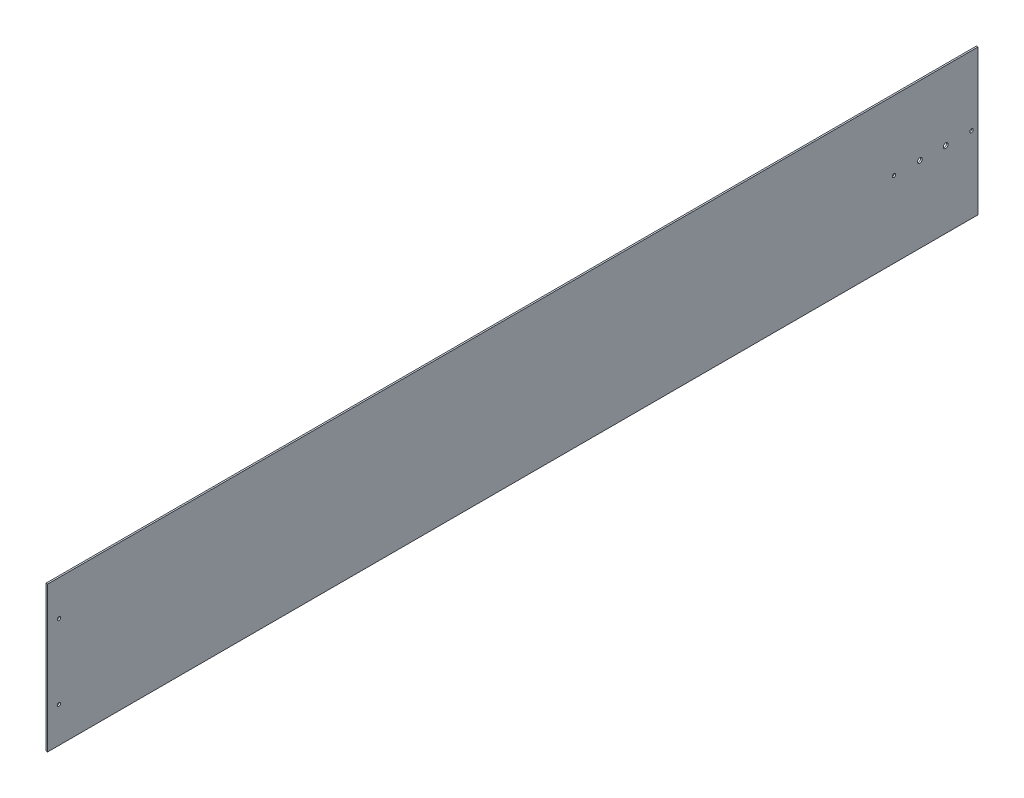
ISO-10303-21;
HEADER;
FILE_DESCRIPTION(('STEP AP214'),'2;1');
FILE_NAME('part.step','',(''),(''),'','','');
FILE_SCHEMA(('AUTOMOTIVE_DESIGN { 1 0 10303 214 1 1 1 1 }'));
ENDSEC;
DATA;
#1=APPLICATION_CONTEXT('core data for automotive mechanical design processes');
#2=APPLICATION_PROTOCOL_DEFINITION('international standard','automotive_design',2000,#1);
#3=PRODUCT_CONTEXT('',#1,'mechanical');
#4=PRODUCT('Part','Part','',(#3));
#5=PRODUCT_RELATED_PRODUCT_CATEGORY('part','',(#4));
#6=PRODUCT_DEFINITION_FORMATION('','',#4);
#7=PRODUCT_DEFINITION_CONTEXT('part definition',#1,'design');
#8=PRODUCT_DEFINITION('design','',#6,#7);
#9=PRODUCT_DEFINITION_SHAPE('','',#8);
#10=(LENGTH_UNIT() NAMED_UNIT(*) SI_UNIT(.MILLI.,.METRE.));
#11=(NAMED_UNIT(*) PLANE_ANGLE_UNIT() SI_UNIT($,.RADIAN.));
#12=(NAMED_UNIT(*) SI_UNIT($,.STERADIAN.) SOLID_ANGLE_UNIT());
#13=UNCERTAINTY_MEASURE_WITH_UNIT(LENGTH_MEASURE(1.E-05),#10,'distance_accuracy_value','');
#14=(GEOMETRIC_REPRESENTATION_CONTEXT(3) GLOBAL_UNCERTAINTY_ASSIGNED_CONTEXT((#13)) GLOBAL_UNIT_ASSIGNED_CONTEXT((#10,
#11,#12)) REPRESENTATION_CONTEXT('',''));
#15=CARTESIAN_POINT('',(0.,0.,0.));
#16=DIRECTION('',(0.,0.,1.));
#17=DIRECTION('',(1.,0.,0.));
#18=AXIS2_PLACEMENT_3D('',#15,#16,#17);
#19=CARTESIAN_POINT('',(3.175,0.,0.));
#20=DIRECTION('',(1.,0.,0.));
#21=DIRECTION('',(0.,0.,-1.));
#22=AXIS2_PLACEMENT_3D('',#19,#20,#21);
#23=PLANE('',#22);
#24=CARTESIAN_POINT('',(3.175,73.025,892.175));
#25=DIRECTION('',(1.,0.,0.));
#26=DIRECTION('',(0.,0.,-1.));
#27=AXIS2_PLACEMENT_3D('',#24,#25,#26);
#28=CIRCLE('',#27,3.302);
#29=CARTESIAN_POINT('',(3.175,73.025,888.873));
#30=VERTEX_POINT('',#29);
#31=EDGE_CURVE('E98',#30,#30,#28,.F.);
#32=ORIENTED_EDGE('',*,*,#31,.T.);
#33=EDGE_LOOP('',(#32));
#34=FACE_BOUND('',#33,.T.);
#35=CARTESIAN_POINT('',(3.175,-73.025,892.175));
#36=DIRECTION('',(1.,0.,0.));
#37=DIRECTION('',(0.,0.,-1.));
#38=AXIS2_PLACEMENT_3D('',#35,#36,#37);
#39=CIRCLE('',#38,3.302);
#40=CARTESIAN_POINT('',(3.175,-73.025,888.873));
#41=VERTEX_POINT('',#40);
#42=EDGE_CURVE('E101',#41,#41,#39,.F.);
#43=ORIENTED_EDGE('',*,*,#42,.T.);
#44=EDGE_LOOP('',(#43));
#45=FACE_BOUND('',#44,.T.);
#46=CARTESIAN_POINT('',(3.175,6.604,-749.3));
#47=DIRECTION('',(-1.,0.,0.));
#48=DIRECTION('',(0.,0.,1.));
#49=AXIS2_PLACEMENT_3D('',#46,#47,#48);
#50=CIRCLE('',#49,3.3655);
#51=CARTESIAN_POINT('',(3.175,6.604,-745.9345));
#52=VERTEX_POINT('',#51);
#53=EDGE_CURVE('E104',#52,#52,#50,.T.);
#54=ORIENTED_EDGE('',*,*,#53,.T.);
#55=EDGE_LOOP('',(#54));
#56=FACE_BOUND('',#55,.T.);
#57=CARTESIAN_POINT('',(3.175,6.604,-800.1));
#58=DIRECTION('',(-1.,0.,0.));
#59=DIRECTION('',(0.,0.,1.));
#60=AXIS2_PLACEMENT_3D('',#57,#58,#59);
#61=CIRCLE('',#60,4.7625);
#62=CARTESIAN_POINT('',(3.175,6.604,-795.3375));
#63=VERTEX_POINT('',#62);
#64=EDGE_CURVE('E107',#63,#63,#61,.T.);
#65=ORIENTED_EDGE('',*,*,#64,.T.);
#66=EDGE_LOOP('',(#65));
#67=FACE_BOUND('',#66,.T.);
#68=CARTESIAN_POINT('',(3.175,6.604,-850.9));
#69=DIRECTION('',(-1.,0.,0.));
#70=DIRECTION('',(0.,0.,1.));
#71=AXIS2_PLACEMENT_3D('',#68,#69,#70);
#72=CIRCLE('',#71,4.7625);
#73=CARTESIAN_POINT('',(3.175,6.604,-846.1375));
#74=VERTEX_POINT('',#73);
#75=EDGE_CURVE('E109',#74,#74,#72,.T.);
#76=ORIENTED_EDGE('',*,*,#75,.T.);
#77=EDGE_LOOP('',(#76));
#78=FACE_BOUND('',#77,.T.);
#79=CARTESIAN_POINT('',(3.175,6.604,-901.7));
#80=DIRECTION('',(-1.,0.,0.));
#81=DIRECTION('',(0.,0.,1.));
#82=AXIS2_PLACEMENT_3D('',#79,#80,#81);
#83=CIRCLE('',#82,3.3655);
#84=CARTESIAN_POINT('',(3.175,6.604,-898.3345));
#85=VERTEX_POINT('',#84);
#86=EDGE_CURVE('E20',#85,#85,#83,.T.);
#87=ORIENTED_EDGE('',*,*,#86,.T.);
#88=EDGE_LOOP('',(#87));
#89=FACE_BOUND('',#88,.T.);
#90=DIRECTION('',(0.,0.,1.));
#91=VECTOR('',#90,1.);
#92=CARTESIAN_POINT('',(3.175,142.875,-914.4));
#93=LINE('',#92,#91);
#94=CARTESIAN_POINT('',(3.175,142.875,914.4));
#95=VERTEX_POINT('',#94);
#96=CARTESIAN_POINT('',(3.175,142.875,-914.4));
#97=VERTEX_POINT('',#96);
#98=EDGE_CURVE('E71',#95,#97,#93,.F.);
#99=ORIENTED_EDGE('',*,*,#98,.F.);
#100=DIRECTION('',(0.,1.,0.));
#101=VECTOR('',#100,1.);
#102=CARTESIAN_POINT('',(3.175,142.875,914.4));
#103=LINE('',#102,#101);
#104=CARTESIAN_POINT('',(3.175,-142.875,914.4));
#105=VERTEX_POINT('',#104);
#106=EDGE_CURVE('E68',#105,#95,#103,.T.);
#107=ORIENTED_EDGE('',*,*,#106,.F.);
#108=DIRECTION('',(0.,0.,-1.));
#109=VECTOR('',#108,1.);
#110=CARTESIAN_POINT('',(3.175,-142.875,914.4));
#111=LINE('',#110,#109);
#112=CARTESIAN_POINT('',(3.175,-142.875,-914.4));
#113=VERTEX_POINT('',#112);
#114=EDGE_CURVE('E59',#113,#105,#111,.F.);
#115=ORIENTED_EDGE('',*,*,#114,.F.);
#116=DIRECTION('',(0.,1.,0.));
#117=VECTOR('',#116,1.);
#118=CARTESIAN_POINT('',(3.175,-142.875,-914.4));
#119=LINE('',#118,#117);
#120=EDGE_CURVE('E54',#97,#113,#119,.F.);
#121=ORIENTED_EDGE('',*,*,#120,.F.);
#122=EDGE_LOOP('',(#99,#107,#115,#121));
#123=FACE_BOUND('',#122,.T.);
#124=ADVANCED_FACE('F17',(#34,#45,#56,#67,#78,#89,#123),#23,.T.);
#125=CARTESIAN_POINT('',(0.,142.875,914.4));
#126=DIRECTION('',(0.,0.,1.));
#127=DIRECTION('',(1.,0.,0.));
#128=AXIS2_PLACEMENT_3D('',#125,#126,#127);
#129=PLANE('',#128);
#130=DIRECTION('',(1.,0.,0.));
#131=VECTOR('',#130,1.);
#132=CARTESIAN_POINT('',(0.,142.875,914.4));
#133=LINE('',#132,#131);
#134=CARTESIAN_POINT('',(0.,142.875,914.4));
#135=VERTEX_POINT('',#134);
#136=EDGE_CURVE('E117',#135,#95,#133,.T.);
#137=ORIENTED_EDGE('',*,*,#136,.F.);
#138=DIRECTION('',(0.,1.,0.));
#139=VECTOR('',#138,1.);
#140=CARTESIAN_POINT('',(0.,0.,914.4));
#141=LINE('',#140,#139);
#142=CARTESIAN_POINT('',(0.,-142.875,914.4));
#143=VERTEX_POINT('',#142);
#144=EDGE_CURVE('E78',#135,#143,#141,.F.);
#145=ORIENTED_EDGE('',*,*,#144,.T.);
#146=DIRECTION('',(1.,0.,0.));
#147=VECTOR('',#146,1.);
#148=CARTESIAN_POINT('',(0.,-142.875,914.4));
#149=LINE('',#148,#147);
#150=EDGE_CURVE('E64',#105,#143,#149,.F.);
#151=ORIENTED_EDGE('',*,*,#150,.F.);
#152=ORIENTED_EDGE('',*,*,#106,.T.);
#153=EDGE_LOOP('',(#137,#145,#151,#152));
#154=FACE_BOUND('',#153,.T.);
#155=ADVANCED_FACE('F77',(#154),#129,.T.);
#156=CARTESIAN_POINT('',(0.,-142.875,914.4));
#157=DIRECTION('',(0.,-1.,0.));
#158=DIRECTION('',(0.,0.,-1.));
#159=AXIS2_PLACEMENT_3D('',#156,#157,#158);
#160=PLANE('',#159);
#161=ORIENTED_EDGE('',*,*,#150,.T.);
#162=DIRECTION('',(0.,0.,-1.));
#163=VECTOR('',#162,1.);
#164=CARTESIAN_POINT('',(0.,-142.875,0.));
#165=LINE('',#164,#163);
#166=CARTESIAN_POINT('',(0.,-142.875,-914.4));
#167=VERTEX_POINT('',#166);
#168=EDGE_CURVE('E128',#143,#167,#165,.T.);
#169=ORIENTED_EDGE('',*,*,#168,.T.);
#170=DIRECTION('',(-1.,0.,0.));
#171=VECTOR('',#170,1.);
#172=CARTESIAN_POINT('',(0.,-142.875,-914.4));
#173=LINE('',#172,#171);
#174=EDGE_CURVE('E66',#113,#167,#173,.T.);
#175=ORIENTED_EDGE('',*,*,#174,.F.);
#176=ORIENTED_EDGE('',*,*,#114,.T.);
#177=EDGE_LOOP('',(#161,#169,#175,#176));
#178=FACE_BOUND('',#177,.T.);
#179=ADVANCED_FACE('F61',(#178),#160,.T.);
#180=CARTESIAN_POINT('',(0.,-142.875,-914.4));
#181=DIRECTION('',(0.,0.,-1.));
#182=DIRECTION('',(-1.,0.,0.));
#183=AXIS2_PLACEMENT_3D('',#180,#181,#182);
#184=PLANE('',#183);
#185=ORIENTED_EDGE('',*,*,#174,.T.);
#186=DIRECTION('',(0.,1.,0.));
#187=VECTOR('',#186,1.);
#188=CARTESIAN_POINT('',(0.,0.,-914.4));
#189=LINE('',#188,#187);
#190=CARTESIAN_POINT('',(0.,142.875,-914.4));
#191=VERTEX_POINT('',#190);
#192=EDGE_CURVE('E125',#167,#191,#189,.T.);
#193=ORIENTED_EDGE('',*,*,#192,.T.);
#194=DIRECTION('',(1.,0.,0.));
#195=VECTOR('',#194,1.);
#196=CARTESIAN_POINT('',(0.,142.875,-914.4));
#197=LINE('',#196,#195);
#198=EDGE_CURVE('E35',#97,#191,#197,.F.);
#199=ORIENTED_EDGE('',*,*,#198,.F.);
#200=ORIENTED_EDGE('',*,*,#120,.T.);
#201=EDGE_LOOP('',(#185,#193,#199,#200));
#202=FACE_BOUND('',#201,.T.);
#203=ADVANCED_FACE('F124',(#202),#184,.T.);
#204=CARTESIAN_POINT('',(0.,142.875,-914.4));
#205=DIRECTION('',(0.,1.,0.));
#206=DIRECTION('',(0.,0.,1.));
#207=AXIS2_PLACEMENT_3D('',#204,#205,#206);
#208=PLANE('',#207);
#209=ORIENTED_EDGE('',*,*,#198,.T.);
#210=DIRECTION('',(0.,0.,-1.));
#211=VECTOR('',#210,1.);
#212=CARTESIAN_POINT('',(0.,142.875,0.));
#213=LINE('',#212,#211);
#214=EDGE_CURVE('E97',#191,#135,#213,.F.);
#215=ORIENTED_EDGE('',*,*,#214,.T.);
#216=ORIENTED_EDGE('',*,*,#136,.T.);
#217=ORIENTED_EDGE('',*,*,#98,.T.);
#218=EDGE_LOOP('',(#209,#215,#216,#217));
#219=FACE_BOUND('',#218,.T.);
#220=ADVANCED_FACE('F131',(#219),#208,.T.);
#221=CARTESIAN_POINT('',(0.,6.604,-901.7));
#222=DIRECTION('',(-1.,0.,0.));
#223=DIRECTION('',(0.,0.,1.));
#224=AXIS2_PLACEMENT_3D('',#221,#222,#223);
#225=CYLINDRICAL_SURFACE('',#224,3.3655);
#226=ORIENTED_EDGE('',*,*,#86,.F.);
#227=EDGE_LOOP('',(#226));
#228=FACE_BOUND('',#227,.T.);
#229=CARTESIAN_POINT('',(0.,6.604,-901.7));
#230=DIRECTION('',(-1.,0.,0.));
#231=DIRECTION('',(0.,0.,1.));
#232=AXIS2_PLACEMENT_3D('',#229,#230,#231);
#233=CIRCLE('',#232,3.3655);
#234=CARTESIAN_POINT('',(0.,6.604,-898.3345));
#235=VERTEX_POINT('',#234);
#236=EDGE_CURVE('E94',#235,#235,#233,.T.);
#237=ORIENTED_EDGE('',*,*,#236,.T.);
#238=EDGE_LOOP('',(#237));
#239=FACE_BOUND('',#238,.T.);
#240=ADVANCED_FACE('F133',(#228,#239),#225,.F.);
#241=CARTESIAN_POINT('',(0.,6.604,-850.9));
#242=DIRECTION('',(-1.,0.,0.));
#243=DIRECTION('',(0.,0.,1.));
#244=AXIS2_PLACEMENT_3D('',#241,#242,#243);
#245=CYLINDRICAL_SURFACE('',#244,4.7625);
#246=ORIENTED_EDGE('',*,*,#75,.F.);
#247=EDGE_LOOP('',(#246));
#248=FACE_BOUND('',#247,.T.);
#249=CARTESIAN_POINT('',(0.,6.604,-850.9));
#250=DIRECTION('',(-1.,0.,0.));
#251=DIRECTION('',(0.,0.,1.));
#252=AXIS2_PLACEMENT_3D('',#249,#250,#251);
#253=CIRCLE('',#252,4.7625);
#254=CARTESIAN_POINT('',(0.,6.604,-846.1375));
#255=VERTEX_POINT('',#254);
#256=EDGE_CURVE('E91',#255,#255,#253,.T.);
#257=ORIENTED_EDGE('',*,*,#256,.T.);
#258=EDGE_LOOP('',(#257));
#259=FACE_BOUND('',#258,.T.);
#260=ADVANCED_FACE('F140',(#248,#259),#245,.F.);
#261=CARTESIAN_POINT('',(0.,6.604,-800.1));
#262=DIRECTION('',(-1.,0.,0.));
#263=DIRECTION('',(0.,0.,1.));
#264=AXIS2_PLACEMENT_3D('',#261,#262,#263);
#265=CYLINDRICAL_SURFACE('',#264,4.7625);
#266=ORIENTED_EDGE('',*,*,#64,.F.);
#267=EDGE_LOOP('',(#266));
#268=FACE_BOUND('',#267,.T.);
#269=CARTESIAN_POINT('',(0.,6.604,-800.1));
#270=DIRECTION('',(-1.,0.,0.));
#271=DIRECTION('',(0.,0.,1.));
#272=AXIS2_PLACEMENT_3D('',#269,#270,#271);
#273=CIRCLE('',#272,4.7625);
#274=CARTESIAN_POINT('',(0.,6.604,-795.3375));
#275=VERTEX_POINT('',#274);
#276=EDGE_CURVE('E88',#275,#275,#273,.T.);
#277=ORIENTED_EDGE('',*,*,#276,.T.);
#278=EDGE_LOOP('',(#277));
#279=FACE_BOUND('',#278,.T.);
#280=ADVANCED_FACE('F163',(#268,#279),#265,.F.);
#281=CARTESIAN_POINT('',(0.,6.604,-749.3));
#282=DIRECTION('',(-1.,0.,0.));
#283=DIRECTION('',(0.,0.,1.));
#284=AXIS2_PLACEMENT_3D('',#281,#282,#283);
#285=CYLINDRICAL_SURFACE('',#284,3.3655);
#286=ORIENTED_EDGE('',*,*,#53,.F.);
#287=EDGE_LOOP('',(#286));
#288=FACE_BOUND('',#287,.T.);
#289=CARTESIAN_POINT('',(0.,6.604,-749.3));
#290=DIRECTION('',(-1.,0.,0.));
#291=DIRECTION('',(0.,0.,1.));
#292=AXIS2_PLACEMENT_3D('',#289,#290,#291);
#293=CIRCLE('',#292,3.3655);
#294=CARTESIAN_POINT('',(0.,6.604,-745.9345));
#295=VERTEX_POINT('',#294);
#296=EDGE_CURVE('E85',#295,#295,#293,.T.);
#297=ORIENTED_EDGE('',*,*,#296,.T.);
#298=EDGE_LOOP('',(#297));
#299=FACE_BOUND('',#298,.T.);
#300=ADVANCED_FACE('F159',(#288,#299),#285,.F.);
#301=CARTESIAN_POINT('',(0.,-73.025,892.175));
#302=DIRECTION('',(1.,0.,0.));
#303=DIRECTION('',(0.,0.,-1.));
#304=AXIS2_PLACEMENT_3D('',#301,#302,#303);
#305=CYLINDRICAL_SURFACE('',#304,3.302);
#306=ORIENTED_EDGE('',*,*,#42,.F.);
#307=EDGE_LOOP('',(#306));
#308=FACE_BOUND('',#307,.T.);
#309=CARTESIAN_POINT('',(0.,-73.025,892.175));
#310=DIRECTION('',(1.,0.,0.));
#311=DIRECTION('',(0.,0.,-1.));
#312=AXIS2_PLACEMENT_3D('',#309,#310,#311);
#313=CIRCLE('',#312,3.302);
#314=CARTESIAN_POINT('',(0.,-73.025,888.873));
#315=VERTEX_POINT('',#314);
#316=EDGE_CURVE('E26',#315,#315,#313,.F.);
#317=ORIENTED_EDGE('',*,*,#316,.T.);
#318=EDGE_LOOP('',(#317));
#319=FACE_BOUND('',#318,.T.);
#320=ADVANCED_FACE('F151',(#308,#319),#305,.F.);
#321=CARTESIAN_POINT('',(0.,73.025,892.175));
#322=DIRECTION('',(1.,0.,0.));
#323=DIRECTION('',(0.,0.,-1.));
#324=AXIS2_PLACEMENT_3D('',#321,#322,#323);
#325=CYLINDRICAL_SURFACE('',#324,3.302);
#326=ORIENTED_EDGE('',*,*,#31,.F.);
#327=EDGE_LOOP('',(#326));
#328=FACE_BOUND('',#327,.T.);
#329=CARTESIAN_POINT('',(0.,73.025,892.175));
#330=DIRECTION('',(1.,0.,0.));
#331=DIRECTION('',(0.,0.,-1.));
#332=AXIS2_PLACEMENT_3D('',#329,#330,#331);
#333=CIRCLE('',#332,3.302);
#334=CARTESIAN_POINT('',(0.,73.025,888.873));
#335=VERTEX_POINT('',#334);
#336=EDGE_CURVE('E11',#335,#335,#333,.F.);
#337=ORIENTED_EDGE('',*,*,#336,.T.);
#338=EDGE_LOOP('',(#337));
#339=FACE_BOUND('',#338,.T.);
#340=ADVANCED_FACE('F145',(#328,#339),#325,.F.);
#341=CARTESIAN_POINT('',(0.,0.,0.));
#342=DIRECTION('',(1.,0.,0.));
#343=DIRECTION('',(0.,0.,-1.));
#344=AXIS2_PLACEMENT_3D('',#341,#342,#343);
#345=PLANE('',#344);
#346=ORIENTED_EDGE('',*,*,#336,.F.);
#347=EDGE_LOOP('',(#346));
#348=FACE_BOUND('',#347,.T.);
#349=ORIENTED_EDGE('',*,*,#316,.F.);
#350=EDGE_LOOP('',(#349));
#351=FACE_BOUND('',#350,.T.);
#352=ORIENTED_EDGE('',*,*,#296,.F.);
#353=EDGE_LOOP('',(#352));
#354=FACE_BOUND('',#353,.T.);
#355=ORIENTED_EDGE('',*,*,#276,.F.);
#356=EDGE_LOOP('',(#355));
#357=FACE_BOUND('',#356,.T.);
#358=ORIENTED_EDGE('',*,*,#256,.F.);
#359=EDGE_LOOP('',(#358));
#360=FACE_BOUND('',#359,.T.);
#361=ORIENTED_EDGE('',*,*,#236,.F.);
#362=EDGE_LOOP('',(#361));
#363=FACE_BOUND('',#362,.T.);
#364=ORIENTED_EDGE('',*,*,#192,.F.);
#365=ORIENTED_EDGE('',*,*,#168,.F.);
#366=ORIENTED_EDGE('',*,*,#144,.F.);
#367=ORIENTED_EDGE('',*,*,#214,.F.);
#368=EDGE_LOOP('',(#364,#365,#366,#367));
#369=FACE_BOUND('',#368,.T.);
#370=ADVANCED_FACE('F127',(#348,#351,#354,#357,#360,#363,#369),#345,.F.);
#371=CLOSED_SHELL('',(#124,#155,#179,#203,#220,#240,#260,#280,#300,#320,#340,#370));
#372=MANIFOLD_SOLID_BREP('B1',#371);
#373=ADVANCED_BREP_SHAPE_REPRESENTATION('',(#18,#372),#14);
#374=SHAPE_DEFINITION_REPRESENTATION(#9,#373);
ENDSEC;
END-ISO-10303-21;
